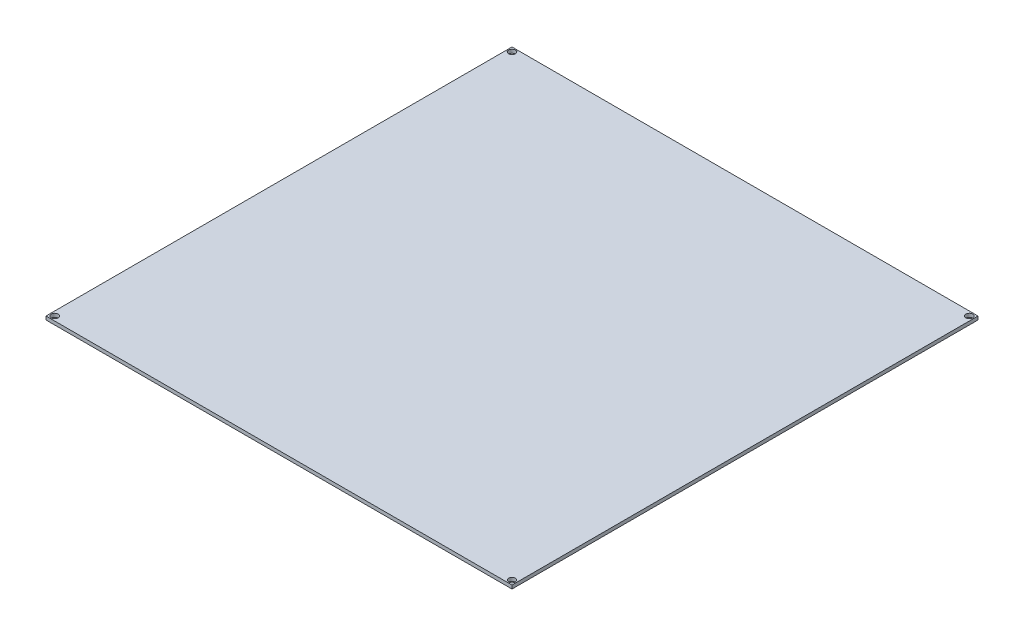
ISO-10303-21;
HEADER;
FILE_DESCRIPTION(('STEP AP214'),'2;1');
FILE_NAME('part.step','',(''),(''),'','','');
FILE_SCHEMA(('AUTOMOTIVE_DESIGN { 1 0 10303 214 1 1 1 1 }'));
ENDSEC;
DATA;
#1=APPLICATION_CONTEXT('core data for automotive mechanical design processes');
#2=APPLICATION_PROTOCOL_DEFINITION('international standard','automotive_design',2000,#1);
#3=PRODUCT_CONTEXT('',#1,'mechanical');
#4=PRODUCT('Part','Part','',(#3));
#5=PRODUCT_RELATED_PRODUCT_CATEGORY('part','',(#4));
#6=PRODUCT_DEFINITION_FORMATION('','',#4);
#7=PRODUCT_DEFINITION_CONTEXT('part definition',#1,'design');
#8=PRODUCT_DEFINITION('design','',#6,#7);
#9=PRODUCT_DEFINITION_SHAPE('','',#8);
#10=(LENGTH_UNIT() NAMED_UNIT(*) SI_UNIT(.MILLI.,.METRE.));
#11=(NAMED_UNIT(*) PLANE_ANGLE_UNIT() SI_UNIT($,.RADIAN.));
#12=(NAMED_UNIT(*) SI_UNIT($,.STERADIAN.) SOLID_ANGLE_UNIT());
#13=UNCERTAINTY_MEASURE_WITH_UNIT(LENGTH_MEASURE(1.E-05),#10,'distance_accuracy_value','');
#14=(GEOMETRIC_REPRESENTATION_CONTEXT(3) GLOBAL_UNCERTAINTY_ASSIGNED_CONTEXT((#13)) GLOBAL_UNIT_ASSIGNED_CONTEXT((#10,
#11,#12)) REPRESENTATION_CONTEXT('',''));
#15=CARTESIAN_POINT('',(0.,0.,0.));
#16=DIRECTION('',(0.,0.,1.));
#17=DIRECTION('',(1.,0.,0.));
#18=AXIS2_PLACEMENT_3D('',#15,#16,#17);
#19=CARTESIAN_POINT('',(107.,1.6,-107.));
#20=DIRECTION('',(0.,0.,1.));
#21=DIRECTION('',(1.,0.,0.));
#22=AXIS2_PLACEMENT_3D('',#19,#20,#21);
#23=PLANE('',#22);
#24=DIRECTION('',(-1.,0.,0.));
#25=VECTOR('',#24,1.);
#26=CARTESIAN_POINT('',(107.,0.,-107.));
#27=LINE('',#26,#25);
#28=CARTESIAN_POINT('',(107.,0.,-107.));
#29=VERTEX_POINT('',#28);
#30=CARTESIAN_POINT('',(-107.,0.,-107.));
#31=VERTEX_POINT('',#30);
#32=EDGE_CURVE('E98',#29,#31,#27,.T.);
#33=ORIENTED_EDGE('',*,*,#32,.T.);
#34=DIRECTION('',(0.,-1.,0.));
#35=VECTOR('',#34,1.);
#36=CARTESIAN_POINT('',(-107.,1.6,-107.));
#37=LINE('',#36,#35);
#38=CARTESIAN_POINT('',(-107.,1.6,-107.));
#39=VERTEX_POINT('',#38);
#40=EDGE_CURVE('E11',#39,#31,#37,.T.);
#41=ORIENTED_EDGE('',*,*,#40,.F.);
#42=DIRECTION('',(-1.,0.,0.));
#43=VECTOR('',#42,1.);
#44=CARTESIAN_POINT('',(107.,1.6,-107.));
#45=LINE('',#44,#43);
#46=CARTESIAN_POINT('',(107.,1.6,-107.));
#47=VERTEX_POINT('',#46);
#48=EDGE_CURVE('E84',#47,#39,#45,.T.);
#49=ORIENTED_EDGE('',*,*,#48,.F.);
#50=DIRECTION('',(0.,-1.,0.));
#51=VECTOR('',#50,1.);
#52=CARTESIAN_POINT('',(107.,1.6,-107.));
#53=LINE('',#52,#51);
#54=EDGE_CURVE('E51',#47,#29,#53,.T.);
#55=ORIENTED_EDGE('',*,*,#54,.T.);
#56=EDGE_LOOP('',(#33,#41,#49,#55));
#57=FACE_BOUND('',#56,.T.);
#58=ADVANCED_FACE('F35',(#57),#23,.F.);
#59=CARTESIAN_POINT('',(-107.,1.6,-107.));
#60=DIRECTION('',(1.,0.,0.));
#61=DIRECTION('',(0.,0.,-1.));
#62=AXIS2_PLACEMENT_3D('',#59,#60,#61);
#63=PLANE('',#62);
#64=DIRECTION('',(0.,0.,1.));
#65=VECTOR('',#64,1.);
#66=CARTESIAN_POINT('',(-107.,0.,-107.));
#67=LINE('',#66,#65);
#68=CARTESIAN_POINT('',(-107.,0.,107.));
#69=VERTEX_POINT('',#68);
#70=EDGE_CURVE('E89',#31,#69,#67,.T.);
#71=ORIENTED_EDGE('',*,*,#70,.T.);
#72=DIRECTION('',(0.,-1.,0.));
#73=VECTOR('',#72,1.);
#74=CARTESIAN_POINT('',(-107.,1.6,107.));
#75=LINE('',#74,#73);
#76=CARTESIAN_POINT('',(-107.,1.6,107.));
#77=VERTEX_POINT('',#76);
#78=EDGE_CURVE('E43',#77,#69,#75,.T.);
#79=ORIENTED_EDGE('',*,*,#78,.F.);
#80=DIRECTION('',(0.,0.,1.));
#81=VECTOR('',#80,1.);
#82=CARTESIAN_POINT('',(-107.,1.6,-107.));
#83=LINE('',#82,#81);
#84=EDGE_CURVE('E76',#39,#77,#83,.T.);
#85=ORIENTED_EDGE('',*,*,#84,.F.);
#86=ORIENTED_EDGE('',*,*,#40,.T.);
#87=EDGE_LOOP('',(#71,#79,#85,#86));
#88=FACE_BOUND('',#87,.T.);
#89=ADVANCED_FACE('F88',(#88),#63,.F.);
#90=CARTESIAN_POINT('',(107.,1.6,107.));
#91=DIRECTION('',(0.,0.,1.));
#92=DIRECTION('',(1.,0.,0.));
#93=AXIS2_PLACEMENT_3D('',#90,#91,#92);
#94=PLANE('',#93);
#95=DIRECTION('',(-1.,0.,0.));
#96=VECTOR('',#95,1.);
#97=CARTESIAN_POINT('',(107.,0.,107.));
#98=LINE('',#97,#96);
#99=CARTESIAN_POINT('',(107.,0.,107.));
#100=VERTEX_POINT('',#99);
#101=EDGE_CURVE('E102',#100,#69,#98,.T.);
#102=ORIENTED_EDGE('',*,*,#101,.F.);
#103=DIRECTION('',(0.,-1.,0.));
#104=VECTOR('',#103,1.);
#105=CARTESIAN_POINT('',(107.,1.6,107.));
#106=LINE('',#105,#104);
#107=CARTESIAN_POINT('',(107.,1.6,107.));
#108=VERTEX_POINT('',#107);
#109=EDGE_CURVE('E65',#108,#100,#106,.T.);
#110=ORIENTED_EDGE('',*,*,#109,.F.);
#111=DIRECTION('',(-1.,0.,0.));
#112=VECTOR('',#111,1.);
#113=CARTESIAN_POINT('',(107.,1.6,107.));
#114=LINE('',#113,#112);
#115=EDGE_CURVE('E83',#108,#77,#114,.T.);
#116=ORIENTED_EDGE('',*,*,#115,.T.);
#117=ORIENTED_EDGE('',*,*,#78,.T.);
#118=EDGE_LOOP('',(#102,#110,#116,#117));
#119=FACE_BOUND('',#118,.T.);
#120=ADVANCED_FACE('F92',(#119),#94,.T.);
#121=CARTESIAN_POINT('',(107.,1.6,-107.));
#122=DIRECTION('',(1.,0.,0.));
#123=DIRECTION('',(0.,0.,-1.));
#124=AXIS2_PLACEMENT_3D('',#121,#122,#123);
#125=PLANE('',#124);
#126=DIRECTION('',(0.,0.,1.));
#127=VECTOR('',#126,1.);
#128=CARTESIAN_POINT('',(107.,0.,-107.));
#129=LINE('',#128,#127);
#130=EDGE_CURVE('E104',#29,#100,#129,.T.);
#131=ORIENTED_EDGE('',*,*,#130,.F.);
#132=ORIENTED_EDGE('',*,*,#54,.F.);
#133=DIRECTION('',(0.,0.,1.));
#134=VECTOR('',#133,1.);
#135=CARTESIAN_POINT('',(107.,1.6,-107.));
#136=LINE('',#135,#134);
#137=EDGE_CURVE('E93',#47,#108,#136,.T.);
#138=ORIENTED_EDGE('',*,*,#137,.T.);
#139=ORIENTED_EDGE('',*,*,#109,.T.);
#140=EDGE_LOOP('',(#131,#132,#138,#139));
#141=FACE_BOUND('',#140,.T.);
#142=ADVANCED_FACE('F140',(#141),#125,.T.);
#143=CARTESIAN_POINT('',(0.,1.6,0.));
#144=DIRECTION('',(0.,1.,0.));
#145=DIRECTION('',(0.,0.,1.));
#146=AXIS2_PLACEMENT_3D('',#143,#144,#145);
#147=PLANE('',#146);
#148=CARTESIAN_POINT('',(-105.,1.6,-105.));
#149=DIRECTION('',(0.,1.,0.));
#150=DIRECTION('',(0.,0.,1.));
#151=AXIS2_PLACEMENT_3D('',#148,#149,#150);
#152=CIRCLE('',#151,1.55);
#153=CARTESIAN_POINT('',(-105.,1.6,-103.45));
#154=VERTEX_POINT('',#153);
#155=EDGE_CURVE('E130',#154,#154,#152,.T.);
#156=ORIENTED_EDGE('',*,*,#155,.F.);
#157=EDGE_LOOP('',(#156));
#158=FACE_BOUND('',#157,.T.);
#159=CARTESIAN_POINT('',(105.,1.6,-105.));
#160=DIRECTION('',(0.,1.,0.));
#161=DIRECTION('',(0.,0.,1.));
#162=AXIS2_PLACEMENT_3D('',#159,#160,#161);
#163=CIRCLE('',#162,1.55);
#164=CARTESIAN_POINT('',(105.,1.6,-103.45));
#165=VERTEX_POINT('',#164);
#166=EDGE_CURVE('E124',#165,#165,#163,.T.);
#167=ORIENTED_EDGE('',*,*,#166,.F.);
#168=EDGE_LOOP('',(#167));
#169=FACE_BOUND('',#168,.T.);
#170=CARTESIAN_POINT('',(105.,1.6,105.000000000002));
#171=DIRECTION('',(0.,1.,0.));
#172=DIRECTION('',(0.,0.,1.));
#173=AXIS2_PLACEMENT_3D('',#170,#171,#172);
#174=CIRCLE('',#173,1.55);
#175=CARTESIAN_POINT('',(105.,1.6,106.550000000002));
#176=VERTEX_POINT('',#175);
#177=EDGE_CURVE('E118',#176,#176,#174,.T.);
#178=ORIENTED_EDGE('',*,*,#177,.F.);
#179=EDGE_LOOP('',(#178));
#180=FACE_BOUND('',#179,.T.);
#181=CARTESIAN_POINT('',(-104.999999999998,1.6,105.));
#182=DIRECTION('',(0.,1.,0.));
#183=DIRECTION('',(0.,0.,1.));
#184=AXIS2_PLACEMENT_3D('',#181,#182,#183);
#185=CIRCLE('',#184,1.55);
#186=CARTESIAN_POINT('',(-104.999999999998,1.6,106.55));
#187=VERTEX_POINT('',#186);
#188=EDGE_CURVE('E112',#187,#187,#185,.T.);
#189=ORIENTED_EDGE('',*,*,#188,.F.);
#190=EDGE_LOOP('',(#189));
#191=FACE_BOUND('',#190,.T.);
#192=ORIENTED_EDGE('',*,*,#48,.T.);
#193=ORIENTED_EDGE('',*,*,#84,.T.);
#194=ORIENTED_EDGE('',*,*,#115,.F.);
#195=ORIENTED_EDGE('',*,*,#137,.F.);
#196=EDGE_LOOP('',(#192,#193,#194,#195));
#197=FACE_BOUND('',#196,.T.);
#198=ADVANCED_FACE('F80',(#158,#169,#180,#191,#197),#147,.T.);
#199=CARTESIAN_POINT('',(0.,0.,0.));
#200=DIRECTION('',(0.,1.,0.));
#201=DIRECTION('',(0.,0.,1.));
#202=AXIS2_PLACEMENT_3D('',#199,#200,#201);
#203=PLANE('',#202);
#204=CARTESIAN_POINT('',(-105.,0.,-105.));
#205=DIRECTION('',(0.,1.,0.));
#206=DIRECTION('',(0.,0.,1.));
#207=AXIS2_PLACEMENT_3D('',#204,#205,#206);
#208=CIRCLE('',#207,1.55);
#209=CARTESIAN_POINT('',(-105.,0.,-103.45));
#210=VERTEX_POINT('',#209);
#211=EDGE_CURVE('E127',#210,#210,#208,.T.);
#212=ORIENTED_EDGE('',*,*,#211,.T.);
#213=EDGE_LOOP('',(#212));
#214=FACE_BOUND('',#213,.T.);
#215=CARTESIAN_POINT('',(105.,0.,-105.));
#216=DIRECTION('',(0.,1.,0.));
#217=DIRECTION('',(0.,0.,1.));
#218=AXIS2_PLACEMENT_3D('',#215,#216,#217);
#219=CIRCLE('',#218,1.55);
#220=CARTESIAN_POINT('',(105.,0.,-103.45));
#221=VERTEX_POINT('',#220);
#222=EDGE_CURVE('E121',#221,#221,#219,.T.);
#223=ORIENTED_EDGE('',*,*,#222,.T.);
#224=EDGE_LOOP('',(#223));
#225=FACE_BOUND('',#224,.T.);
#226=CARTESIAN_POINT('',(105.,0.,105.000000000002));
#227=DIRECTION('',(0.,1.,0.));
#228=DIRECTION('',(0.,0.,1.));
#229=AXIS2_PLACEMENT_3D('',#226,#227,#228);
#230=CIRCLE('',#229,1.55);
#231=CARTESIAN_POINT('',(105.,0.,106.550000000002));
#232=VERTEX_POINT('',#231);
#233=EDGE_CURVE('E115',#232,#232,#230,.T.);
#234=ORIENTED_EDGE('',*,*,#233,.T.);
#235=EDGE_LOOP('',(#234));
#236=FACE_BOUND('',#235,.T.);
#237=CARTESIAN_POINT('',(-104.999999999998,0.,105.));
#238=DIRECTION('',(0.,1.,0.));
#239=DIRECTION('',(0.,0.,1.));
#240=AXIS2_PLACEMENT_3D('',#237,#238,#239);
#241=CIRCLE('',#240,1.55);
#242=CARTESIAN_POINT('',(-104.999999999998,0.,106.55));
#243=VERTEX_POINT('',#242);
#244=EDGE_CURVE('E100',#243,#243,#241,.T.);
#245=ORIENTED_EDGE('',*,*,#244,.T.);
#246=EDGE_LOOP('',(#245));
#247=FACE_BOUND('',#246,.T.);
#248=ORIENTED_EDGE('',*,*,#32,.F.);
#249=ORIENTED_EDGE('',*,*,#130,.T.);
#250=ORIENTED_EDGE('',*,*,#101,.T.);
#251=ORIENTED_EDGE('',*,*,#70,.F.);
#252=EDGE_LOOP('',(#248,#249,#250,#251));
#253=FACE_BOUND('',#252,.T.);
#254=ADVANCED_FACE('F139',(#214,#225,#236,#247,#253),#203,.F.);
#255=CARTESIAN_POINT('',(-104.999999999998,1.6,105.));
#256=DIRECTION('',(0.,1.,0.));
#257=DIRECTION('',(0.,0.,1.));
#258=AXIS2_PLACEMENT_3D('',#255,#256,#257);
#259=CYLINDRICAL_SURFACE('',#258,1.55);
#260=ORIENTED_EDGE('',*,*,#188,.T.);
#261=EDGE_LOOP('',(#260));
#262=FACE_BOUND('',#261,.T.);
#263=ORIENTED_EDGE('',*,*,#244,.F.);
#264=EDGE_LOOP('',(#263));
#265=FACE_BOUND('',#264,.T.);
#266=ADVANCED_FACE('F148',(#262,#265),#259,.F.);
#267=CARTESIAN_POINT('',(105.,1.6,105.000000000002));
#268=DIRECTION('',(0.,1.,0.));
#269=DIRECTION('',(0.,0.,1.));
#270=AXIS2_PLACEMENT_3D('',#267,#268,#269);
#271=CYLINDRICAL_SURFACE('',#270,1.55);
#272=ORIENTED_EDGE('',*,*,#177,.T.);
#273=EDGE_LOOP('',(#272));
#274=FACE_BOUND('',#273,.T.);
#275=ORIENTED_EDGE('',*,*,#233,.F.);
#276=EDGE_LOOP('',(#275));
#277=FACE_BOUND('',#276,.T.);
#278=ADVANCED_FACE('F151',(#274,#277),#271,.F.);
#279=CARTESIAN_POINT('',(105.,1.6,-105.));
#280=DIRECTION('',(0.,1.,0.));
#281=DIRECTION('',(0.,0.,1.));
#282=AXIS2_PLACEMENT_3D('',#279,#280,#281);
#283=CYLINDRICAL_SURFACE('',#282,1.55);
#284=ORIENTED_EDGE('',*,*,#166,.T.);
#285=EDGE_LOOP('',(#284));
#286=FACE_BOUND('',#285,.T.);
#287=ORIENTED_EDGE('',*,*,#222,.F.);
#288=EDGE_LOOP('',(#287));
#289=FACE_BOUND('',#288,.T.);
#290=ADVANCED_FACE('F205',(#286,#289),#283,.F.);
#291=CARTESIAN_POINT('',(-105.,1.6,-105.));
#292=DIRECTION('',(0.,1.,0.));
#293=DIRECTION('',(0.,0.,1.));
#294=AXIS2_PLACEMENT_3D('',#291,#292,#293);
#295=CYLINDRICAL_SURFACE('',#294,1.55);
#296=ORIENTED_EDGE('',*,*,#155,.T.);
#297=EDGE_LOOP('',(#296));
#298=FACE_BOUND('',#297,.T.);
#299=ORIENTED_EDGE('',*,*,#211,.F.);
#300=EDGE_LOOP('',(#299));
#301=FACE_BOUND('',#300,.T.);
#302=ADVANCED_FACE('F134',(#298,#301),#295,.F.);
#303=CLOSED_SHELL('',(#58,#89,#120,#142,#198,#254,#266,#278,#290,#302));
#304=MANIFOLD_SOLID_BREP('B2',#303);
#305=ADVANCED_BREP_SHAPE_REPRESENTATION('',(#18,#304),#14);
#306=SHAPE_DEFINITION_REPRESENTATION(#9,#305);
ENDSEC;
END-ISO-10303-21;
